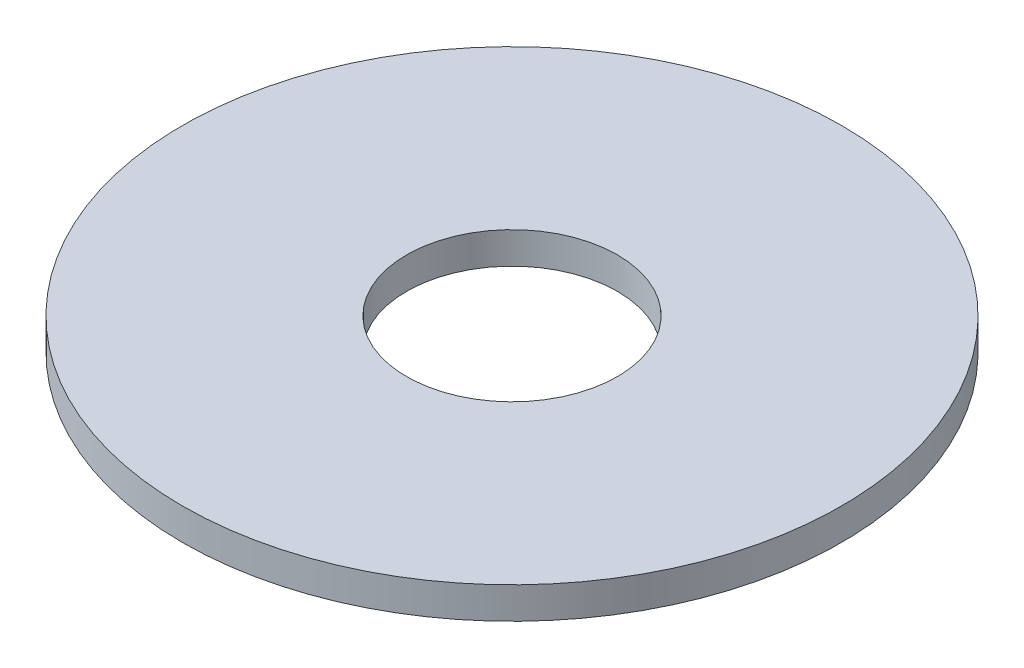
ISO-10303-21;
HEADER;
FILE_DESCRIPTION(('STEP AP214'),'2;1');
FILE_NAME('part.step','',(''),(''),'','','');
FILE_SCHEMA(('AUTOMOTIVE_DESIGN { 1 0 10303 214 1 1 1 1 }'));
ENDSEC;
DATA;
#1=APPLICATION_CONTEXT('core data for automotive mechanical design processes');
#2=APPLICATION_PROTOCOL_DEFINITION('international standard','automotive_design',2000,#1);
#3=PRODUCT_CONTEXT('',#1,'mechanical');
#4=PRODUCT('Part','Part','',(#3));
#5=PRODUCT_RELATED_PRODUCT_CATEGORY('part','',(#4));
#6=PRODUCT_DEFINITION_FORMATION('','',#4);
#7=PRODUCT_DEFINITION_CONTEXT('part definition',#1,'design');
#8=PRODUCT_DEFINITION('design','',#6,#7);
#9=PRODUCT_DEFINITION_SHAPE('','',#8);
#10=(LENGTH_UNIT() NAMED_UNIT(*) SI_UNIT(.MILLI.,.METRE.));
#11=(NAMED_UNIT(*) PLANE_ANGLE_UNIT() SI_UNIT($,.RADIAN.));
#12=(NAMED_UNIT(*) SI_UNIT($,.STERADIAN.) SOLID_ANGLE_UNIT());
#13=UNCERTAINTY_MEASURE_WITH_UNIT(LENGTH_MEASURE(1.E-05),#10,'distance_accuracy_value','');
#14=(GEOMETRIC_REPRESENTATION_CONTEXT(3) GLOBAL_UNCERTAINTY_ASSIGNED_CONTEXT((#13)) GLOBAL_UNIT_ASSIGNED_CONTEXT((#10,
#11,#12)) REPRESENTATION_CONTEXT('',''));
#15=CARTESIAN_POINT('',(0.,0.,0.));
#16=DIRECTION('',(0.,0.,1.));
#17=DIRECTION('',(1.,0.,0.));
#18=AXIS2_PLACEMENT_3D('',#15,#16,#17);
#19=CARTESIAN_POINT('',(0.,0.,0.));
#20=DIRECTION('',(0.,-1.,0.));
#21=DIRECTION('',(0.,0.,-1.));
#22=AXIS2_PLACEMENT_3D('',#19,#20,#21);
#23=CYLINDRICAL_SURFACE('',#22,12.5);
#24=CARTESIAN_POINT('',(0.,0.,0.));
#25=DIRECTION('',(0.,-1.,0.));
#26=DIRECTION('',(0.,0.,-1.));
#27=AXIS2_PLACEMENT_3D('',#24,#25,#26);
#28=CIRCLE('',#27,12.5);
#29=CARTESIAN_POINT('',(0.,0.,-12.5));
#30=VERTEX_POINT('',#29);
#31=EDGE_CURVE('E26',#30,#30,#28,.T.);
#32=ORIENTED_EDGE('',*,*,#31,.F.);
#33=EDGE_LOOP('',(#32));
#34=FACE_BOUND('',#33,.T.);
#35=CARTESIAN_POINT('',(0.,1.2,0.));
#36=DIRECTION('',(0.,-1.,0.));
#37=DIRECTION('',(0.,0.,-1.));
#38=AXIS2_PLACEMENT_3D('',#35,#36,#37);
#39=CIRCLE('',#38,12.5);
#40=CARTESIAN_POINT('',(0.,1.2,-12.5));
#41=VERTEX_POINT('',#40);
#42=EDGE_CURVE('E17',#41,#41,#39,.F.);
#43=ORIENTED_EDGE('',*,*,#42,.F.);
#44=EDGE_LOOP('',(#43));
#45=FACE_BOUND('',#44,.T.);
#46=ADVANCED_FACE('F14',(#34,#45),#23,.T.);
#47=CARTESIAN_POINT('',(0.,1.2,0.));
#48=DIRECTION('',(0.,1.,0.));
#49=DIRECTION('',(0.,0.,1.));
#50=AXIS2_PLACEMENT_3D('',#47,#48,#49);
#51=PLANE('',#50);
#52=CARTESIAN_POINT('',(0.,1.2,0.));
#53=DIRECTION('',(0.,-1.,0.));
#54=DIRECTION('',(0.,0.,-1.));
#55=AXIS2_PLACEMENT_3D('',#52,#53,#54);
#56=CIRCLE('',#55,4.);
#57=CARTESIAN_POINT('',(0.,1.2,-4.));
#58=VERTEX_POINT('',#57);
#59=EDGE_CURVE('E21',#58,#58,#56,.F.);
#60=ORIENTED_EDGE('',*,*,#59,.F.);
#61=EDGE_LOOP('',(#60));
#62=FACE_BOUND('',#61,.T.);
#63=ORIENTED_EDGE('',*,*,#42,.T.);
#64=EDGE_LOOP('',(#63));
#65=FACE_BOUND('',#64,.T.);
#66=ADVANCED_FACE('F34',(#62,#65),#51,.T.);
#67=CARTESIAN_POINT('',(0.,0.,0.));
#68=DIRECTION('',(0.,1.,0.));
#69=DIRECTION('',(0.,0.,1.));
#70=AXIS2_PLACEMENT_3D('',#67,#68,#69);
#71=PLANE('',#70);
#72=CARTESIAN_POINT('',(0.,0.,0.));
#73=DIRECTION('',(0.,-1.,0.));
#74=DIRECTION('',(0.,0.,-1.));
#75=AXIS2_PLACEMENT_3D('',#72,#73,#74);
#76=CIRCLE('',#75,4.);
#77=CARTESIAN_POINT('',(0.,0.,-4.));
#78=VERTEX_POINT('',#77);
#79=EDGE_CURVE('E10',#78,#78,#76,.T.);
#80=ORIENTED_EDGE('',*,*,#79,.F.);
#81=EDGE_LOOP('',(#80));
#82=FACE_BOUND('',#81,.T.);
#83=ORIENTED_EDGE('',*,*,#31,.T.);
#84=EDGE_LOOP('',(#83));
#85=FACE_BOUND('',#84,.T.);
#86=ADVANCED_FACE('F42',(#82,#85),#71,.F.);
#87=CARTESIAN_POINT('',(0.,1.2,0.));
#88=DIRECTION('',(0.,-1.,0.));
#89=DIRECTION('',(0.,0.,-1.));
#90=AXIS2_PLACEMENT_3D('',#87,#88,#89);
#91=CYLINDRICAL_SURFACE('',#90,4.);
#92=ORIENTED_EDGE('',*,*,#59,.T.);
#93=EDGE_LOOP('',(#92));
#94=FACE_BOUND('',#93,.T.);
#95=ORIENTED_EDGE('',*,*,#79,.T.);
#96=EDGE_LOOP('',(#95));
#97=FACE_BOUND('',#96,.T.);
#98=ADVANCED_FACE('F44',(#94,#97),#91,.F.);
#99=CLOSED_SHELL('',(#46,#66,#86,#98));
#100=MANIFOLD_SOLID_BREP('B1',#99);
#101=ADVANCED_BREP_SHAPE_REPRESENTATION('',(#18,#100),#14);
#102=SHAPE_DEFINITION_REPRESENTATION(#9,#101);
ENDSEC;
END-ISO-10303-21;
